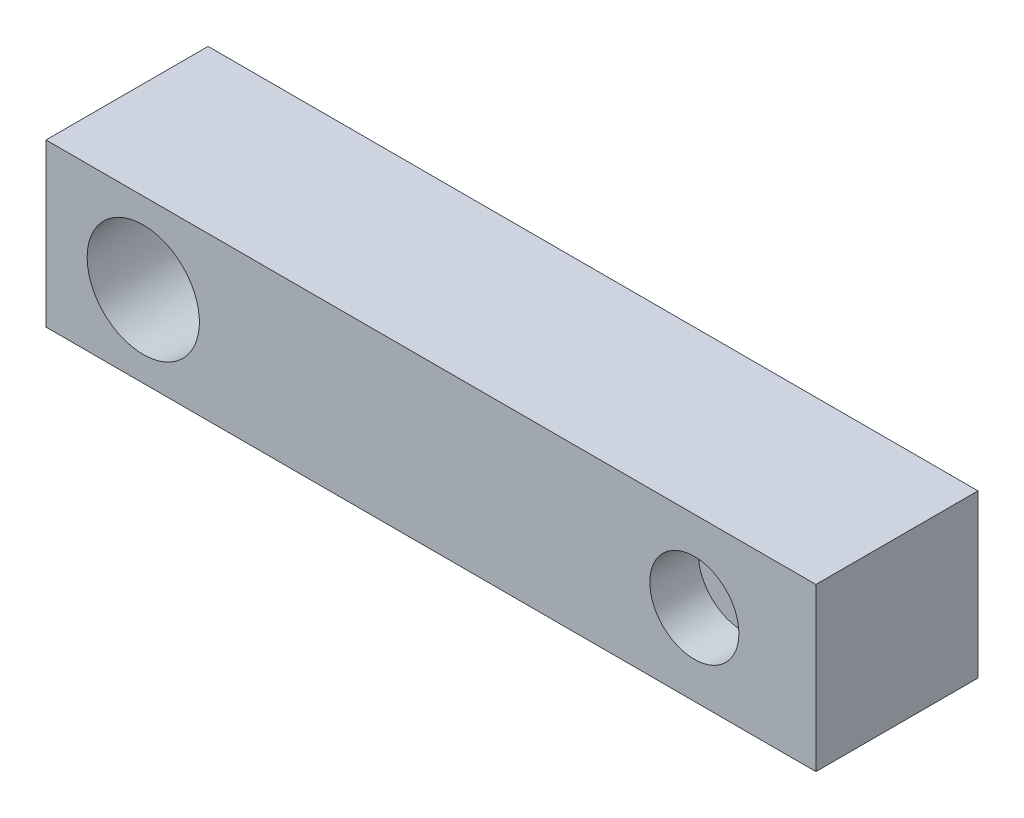
ISO-10303-21;
HEADER;
FILE_DESCRIPTION(('STEP AP214'),'2;1');
FILE_NAME('part.step','',(''),(''),'','','');
FILE_SCHEMA(('AUTOMOTIVE_DESIGN { 1 0 10303 214 1 1 1 1 }'));
ENDSEC;
DATA;
#1=APPLICATION_CONTEXT('core data for automotive mechanical design processes');
#2=APPLICATION_PROTOCOL_DEFINITION('international standard','automotive_design',2000,#1);
#3=PRODUCT_CONTEXT('',#1,'mechanical');
#4=PRODUCT('Part','Part','',(#3));
#5=PRODUCT_RELATED_PRODUCT_CATEGORY('part','',(#4));
#6=PRODUCT_DEFINITION_FORMATION('','',#4);
#7=PRODUCT_DEFINITION_CONTEXT('part definition',#1,'design');
#8=PRODUCT_DEFINITION('design','',#6,#7);
#9=PRODUCT_DEFINITION_SHAPE('','',#8);
#10=(LENGTH_UNIT() NAMED_UNIT(*) SI_UNIT(.MILLI.,.METRE.));
#11=(NAMED_UNIT(*) PLANE_ANGLE_UNIT() SI_UNIT($,.RADIAN.));
#12=(NAMED_UNIT(*) SI_UNIT($,.STERADIAN.) SOLID_ANGLE_UNIT());
#13=UNCERTAINTY_MEASURE_WITH_UNIT(LENGTH_MEASURE(1.E-05),#10,'distance_accuracy_value','');
#14=(GEOMETRIC_REPRESENTATION_CONTEXT(3) GLOBAL_UNCERTAINTY_ASSIGNED_CONTEXT((#13)) GLOBAL_UNIT_ASSIGNED_CONTEXT((#10,
#11,#12)) REPRESENTATION_CONTEXT('',''));
#15=CARTESIAN_POINT('',(0.,0.,0.));
#16=DIRECTION('',(0.,0.,1.));
#17=DIRECTION('',(1.,0.,0.));
#18=AXIS2_PLACEMENT_3D('',#15,#16,#17);
#19=CARTESIAN_POINT('',(68.0000000000001,0.,-3.33066907387547E-13));
#20=DIRECTION('',(0.,0.,-1.));
#21=DIRECTION('',(-1.,0.,0.));
#22=AXIS2_PLACEMENT_3D('',#19,#20,#21);
#23=CYLINDRICAL_SURFACE('',#22,2.75000000000001);
#24=CARTESIAN_POINT('',(68.,0.,-15.0000000000003));
#25=DIRECTION('',(0.,0.,-1.));
#26=DIRECTION('',(-1.,0.,0.));
#27=AXIS2_PLACEMENT_3D('',#24,#25,#26);
#28=CIRCLE('',#27,2.75000000000001);
#29=CARTESIAN_POINT('',(65.25,0.,-15.0000000000003));
#30=VERTEX_POINT('',#29);
#31=EDGE_CURVE('E131',#30,#30,#28,.T.);
#32=ORIENTED_EDGE('',*,*,#31,.T.);
#33=EDGE_LOOP('',(#32));
#34=FACE_BOUND('',#33,.T.);
#35=CARTESIAN_POINT('',(68.,0.,-6.00000000000034));
#36=DIRECTION('',(0.,0.,1.));
#37=DIRECTION('',(1.,0.,0.));
#38=AXIS2_PLACEMENT_3D('',#35,#36,#37);
#39=CIRCLE('',#38,2.75000000000001);
#40=CARTESIAN_POINT('',(70.75,0.,-6.00000000000034));
#41=VERTEX_POINT('',#40);
#42=EDGE_CURVE('E50',#41,#41,#39,.F.);
#43=ORIENTED_EDGE('',*,*,#42,.F.);
#44=EDGE_LOOP('',(#43));
#45=FACE_BOUND('',#44,.T.);
#46=ADVANCED_FACE('F46',(#34,#45),#23,.F.);
#47=CARTESIAN_POINT('',(0.,0.,0.));
#48=DIRECTION('',(0.,0.,-1.));
#49=DIRECTION('',(-1.,0.,0.));
#50=AXIS2_PLACEMENT_3D('',#47,#48,#49);
#51=CONICAL_SURFACE('',#50,6.92584167948768,0.0499164165500011);
#52=CARTESIAN_POINT('',(0.,0.,0.));
#53=DIRECTION('',(0.,0.,-1.));
#54=DIRECTION('',(-1.,0.,0.));
#55=AXIS2_PLACEMENT_3D('',#52,#53,#54);
#56=CIRCLE('',#55,6.92584167948768);
#57=CARTESIAN_POINT('',(-6.92584167948768,0.,0.));
#58=VERTEX_POINT('',#57);
#59=EDGE_CURVE('E63',#58,#58,#56,.T.);
#60=ORIENTED_EDGE('',*,*,#59,.F.);
#61=EDGE_LOOP('',(#60));
#62=FACE_BOUND('',#61,.T.);
#63=CARTESIAN_POINT('',(0.,3.33066907387547E-13,-20.));
#64=DIRECTION('',(0.,0.,-1.));
#65=DIRECTION('',(-1.,0.,0.));
#66=AXIS2_PLACEMENT_3D('',#63,#64,#65);
#67=CIRCLE('',#66,7.925);
#68=CARTESIAN_POINT('',(-7.92499999999999,3.33066907387547E-13,-20.));
#69=VERTEX_POINT('',#68);
#70=EDGE_CURVE('E105',#69,#69,#67,.T.);
#71=ORIENTED_EDGE('',*,*,#70,.T.);
#72=EDGE_LOOP('',(#71));
#73=FACE_BOUND('',#72,.T.);
#74=ADVANCED_FACE('F149',(#62,#73),#51,.F.);
#75=CARTESIAN_POINT('',(83.,10.,-20.0000000000004));
#76=DIRECTION('',(-1.,0.,0.));
#77=DIRECTION('',(0.,0.,1.));
#78=AXIS2_PLACEMENT_3D('',#75,#76,#77);
#79=PLANE('',#78);
#80=DIRECTION('',(0.,-1.,0.));
#81=VECTOR('',#80,1.);
#82=CARTESIAN_POINT('',(83.0000000000001,10.0000000000003,-3.33066907387547E-13));
#83=LINE('',#82,#81);
#84=CARTESIAN_POINT('',(83.0000000000001,10.0000000000003,-3.33066907387547E-13));
#85=VERTEX_POINT('',#84);
#86=CARTESIAN_POINT('',(83.0000000000001,-9.99999999999968,-3.33066907387547E-13));
#87=VERTEX_POINT('',#86);
#88=EDGE_CURVE('E87',#85,#87,#83,.T.);
#89=ORIENTED_EDGE('',*,*,#88,.T.);
#90=DIRECTION('',(0.,0.,1.));
#91=VECTOR('',#90,1.);
#92=CARTESIAN_POINT('',(83.,-10.,-20.0000000000004));
#93=LINE('',#92,#91);
#94=CARTESIAN_POINT('',(83.,-10.,-20.0000000000004));
#95=VERTEX_POINT('',#94);
#96=EDGE_CURVE('E113',#95,#87,#93,.T.);
#97=ORIENTED_EDGE('',*,*,#96,.F.);
#98=DIRECTION('',(0.,-1.,0.));
#99=VECTOR('',#98,1.);
#100=CARTESIAN_POINT('',(83.,10.,-20.0000000000004));
#101=LINE('',#100,#99);
#102=CARTESIAN_POINT('',(83.,10.,-20.0000000000004));
#103=VERTEX_POINT('',#102);
#104=EDGE_CURVE('E90',#103,#95,#101,.T.);
#105=ORIENTED_EDGE('',*,*,#104,.F.);
#106=DIRECTION('',(0.,0.,1.));
#107=VECTOR('',#106,1.);
#108=CARTESIAN_POINT('',(83.,10.,-20.0000000000004));
#109=LINE('',#108,#107);
#110=EDGE_CURVE('E11',#103,#85,#109,.T.);
#111=ORIENTED_EDGE('',*,*,#110,.T.);
#112=EDGE_LOOP('',(#89,#97,#105,#111));
#113=FACE_BOUND('',#112,.T.);
#114=ADVANCED_FACE('F85',(#113),#79,.F.);
#115=CARTESIAN_POINT('',(-11.9999999999998,10.,-20.));
#116=DIRECTION('',(0.,-1.,0.));
#117=DIRECTION('',(0.,0.,-1.));
#118=AXIS2_PLACEMENT_3D('',#115,#116,#117);
#119=PLANE('',#118);
#120=DIRECTION('',(1.,0.,0.));
#121=VECTOR('',#120,1.);
#122=CARTESIAN_POINT('',(-12.,10.0000000000001,0.));
#123=LINE('',#122,#121);
#124=CARTESIAN_POINT('',(-12.,10.0000000000001,0.));
#125=VERTEX_POINT('',#124);
#126=EDGE_CURVE('E95',#125,#85,#123,.T.);
#127=ORIENTED_EDGE('',*,*,#126,.T.);
#128=ORIENTED_EDGE('',*,*,#110,.F.);
#129=DIRECTION('',(1.,0.,0.));
#130=VECTOR('',#129,1.);
#131=CARTESIAN_POINT('',(-11.9999999999998,10.,-20.));
#132=LINE('',#131,#130);
#133=CARTESIAN_POINT('',(-11.9999999999998,10.,-20.));
#134=VERTEX_POINT('',#133);
#135=EDGE_CURVE('E110',#134,#103,#132,.T.);
#136=ORIENTED_EDGE('',*,*,#135,.F.);
#137=DIRECTION('',(0.,0.,1.));
#138=VECTOR('',#137,1.);
#139=CARTESIAN_POINT('',(-11.9999999999998,10.,-20.));
#140=LINE('',#139,#138);
#141=EDGE_CURVE('E56',#134,#125,#140,.T.);
#142=ORIENTED_EDGE('',*,*,#141,.T.);
#143=EDGE_LOOP('',(#127,#128,#136,#142));
#144=FACE_BOUND('',#143,.T.);
#145=ADVANCED_FACE('F96',(#144),#119,.F.);
#146=CARTESIAN_POINT('',(-11.9999999999998,-10.,-20.0000000000003));
#147=DIRECTION('',(1.,0.,0.));
#148=DIRECTION('',(0.,1.,0.));
#149=AXIS2_PLACEMENT_3D('',#146,#147,#148);
#150=PLANE('',#149);
#151=DIRECTION('',(0.,1.,0.));
#152=VECTOR('',#151,1.);
#153=CARTESIAN_POINT('',(-12.,-9.99999999999995,-3.33066907387547E-13));
#154=LINE('',#153,#152);
#155=CARTESIAN_POINT('',(-12.,-9.99999999999995,-3.33066907387547E-13));
#156=VERTEX_POINT('',#155);
#157=EDGE_CURVE('E100',#156,#125,#154,.T.);
#158=ORIENTED_EDGE('',*,*,#157,.T.);
#159=ORIENTED_EDGE('',*,*,#141,.F.);
#160=DIRECTION('',(0.,1.,0.));
#161=VECTOR('',#160,1.);
#162=CARTESIAN_POINT('',(-11.9999999999998,-10.,-20.0000000000003));
#163=LINE('',#162,#161);
#164=CARTESIAN_POINT('',(-11.9999999999998,-10.,-20.0000000000003));
#165=VERTEX_POINT('',#164);
#166=EDGE_CURVE('E108',#165,#134,#163,.T.);
#167=ORIENTED_EDGE('',*,*,#166,.F.);
#168=DIRECTION('',(0.,0.,1.));
#169=VECTOR('',#168,1.);
#170=CARTESIAN_POINT('',(-11.9999999999998,-10.,-20.0000000000003));
#171=LINE('',#170,#169);
#172=EDGE_CURVE('E116',#165,#156,#171,.T.);
#173=ORIENTED_EDGE('',*,*,#172,.T.);
#174=EDGE_LOOP('',(#158,#159,#167,#173));
#175=FACE_BOUND('',#174,.T.);
#176=ADVANCED_FACE('F168',(#175),#150,.F.);
#177=CARTESIAN_POINT('',(83.,-10.,-20.0000000000004));
#178=DIRECTION('',(0.,1.,0.));
#179=DIRECTION('',(1.,0.,0.));
#180=AXIS2_PLACEMENT_3D('',#177,#178,#179);
#181=PLANE('',#180);
#182=DIRECTION('',(-1.,0.,0.));
#183=VECTOR('',#182,1.);
#184=CARTESIAN_POINT('',(83.0000000000001,-9.99999999999968,-3.33066907387547E-13));
#185=LINE('',#184,#183);
#186=EDGE_CURVE('E103',#87,#156,#185,.T.);
#187=ORIENTED_EDGE('',*,*,#186,.T.);
#188=ORIENTED_EDGE('',*,*,#172,.F.);
#189=DIRECTION('',(-1.,0.,0.));
#190=VECTOR('',#189,1.);
#191=CARTESIAN_POINT('',(83.,-10.,-20.0000000000004));
#192=LINE('',#191,#190);
#193=EDGE_CURVE('E111',#95,#165,#192,.T.);
#194=ORIENTED_EDGE('',*,*,#193,.F.);
#195=ORIENTED_EDGE('',*,*,#96,.T.);
#196=EDGE_LOOP('',(#187,#188,#194,#195));
#197=FACE_BOUND('',#196,.T.);
#198=ADVANCED_FACE('F171',(#197),#181,.F.);
#199=CARTESIAN_POINT('',(-12.,-9.99999999999995,-3.33066907387547E-13));
#200=DIRECTION('',(0.,0.,-1.));
#201=DIRECTION('',(0.,-1.,0.));
#202=AXIS2_PLACEMENT_3D('',#199,#200,#201);
#203=PLANE('',#202);
#204=CARTESIAN_POINT('',(68.0000000000001,0.,-3.33066907387547E-13));
#205=DIRECTION('',(0.,0.,1.));
#206=DIRECTION('',(1.,0.,0.));
#207=AXIS2_PLACEMENT_3D('',#204,#205,#206);
#208=CIRCLE('',#207,5.5);
#209=CARTESIAN_POINT('',(73.5000000000001,0.,-3.33066907387547E-13));
#210=VERTEX_POINT('',#209);
#211=EDGE_CURVE('E136',#210,#210,#208,.T.);
#212=ORIENTED_EDGE('',*,*,#211,.F.);
#213=EDGE_LOOP('',(#212));
#214=FACE_BOUND('',#213,.T.);
#215=ORIENTED_EDGE('',*,*,#59,.T.);
#216=EDGE_LOOP('',(#215));
#217=FACE_BOUND('',#216,.T.);
#218=ORIENTED_EDGE('',*,*,#186,.F.);
#219=ORIENTED_EDGE('',*,*,#88,.F.);
#220=ORIENTED_EDGE('',*,*,#126,.F.);
#221=ORIENTED_EDGE('',*,*,#157,.F.);
#222=EDGE_LOOP('',(#218,#219,#220,#221));
#223=FACE_BOUND('',#222,.T.);
#224=ADVANCED_FACE('F101',(#214,#217,#223),#203,.F.);
#225=CARTESIAN_POINT('',(-11.9999999999998,-10.,-20.0000000000003));
#226=DIRECTION('',(0.,0.,-1.));
#227=DIRECTION('',(0.,-1.,0.));
#228=AXIS2_PLACEMENT_3D('',#225,#226,#227);
#229=PLANE('',#228);
#230=CARTESIAN_POINT('',(68.,0.,-20.0000000000003));
#231=DIRECTION('',(0.,0.,-1.));
#232=DIRECTION('',(-1.,0.,0.));
#233=AXIS2_PLACEMENT_3D('',#230,#231,#232);
#234=CIRCLE('',#233,7.5);
#235=CARTESIAN_POINT('',(60.5,0.,-20.0000000000003));
#236=VERTEX_POINT('',#235);
#237=EDGE_CURVE('E128',#236,#236,#234,.T.);
#238=ORIENTED_EDGE('',*,*,#237,.F.);
#239=EDGE_LOOP('',(#238));
#240=FACE_BOUND('',#239,.T.);
#241=ORIENTED_EDGE('',*,*,#70,.F.);
#242=EDGE_LOOP('',(#241));
#243=FACE_BOUND('',#242,.T.);
#244=ORIENTED_EDGE('',*,*,#193,.T.);
#245=ORIENTED_EDGE('',*,*,#166,.T.);
#246=ORIENTED_EDGE('',*,*,#135,.T.);
#247=ORIENTED_EDGE('',*,*,#104,.T.);
#248=EDGE_LOOP('',(#244,#245,#246,#247));
#249=FACE_BOUND('',#248,.T.);
#250=ADVANCED_FACE('F48',(#240,#243,#249),#229,.T.);
#251=CARTESIAN_POINT('',(68.,0.,-15.0000000000003));
#252=DIRECTION('',(0.,0.,-1.));
#253=DIRECTION('',(-1.,0.,0.));
#254=AXIS2_PLACEMENT_3D('',#251,#252,#253);
#255=CYLINDRICAL_SURFACE('',#254,7.5);
#256=CARTESIAN_POINT('',(68.,0.,-15.0000000000003));
#257=DIRECTION('',(0.,0.,-1.));
#258=DIRECTION('',(-1.,0.,0.));
#259=AXIS2_PLACEMENT_3D('',#256,#257,#258);
#260=CIRCLE('',#259,7.5);
#261=CARTESIAN_POINT('',(60.5,0.,-15.0000000000003));
#262=VERTEX_POINT('',#261);
#263=EDGE_CURVE('E121',#262,#262,#260,.T.);
#264=ORIENTED_EDGE('',*,*,#263,.F.);
#265=EDGE_LOOP('',(#264));
#266=FACE_BOUND('',#265,.T.);
#267=ORIENTED_EDGE('',*,*,#237,.T.);
#268=EDGE_LOOP('',(#267));
#269=FACE_BOUND('',#268,.T.);
#270=ADVANCED_FACE('F163',(#266,#269),#255,.F.);
#271=CARTESIAN_POINT('',(68.,0.,-15.0000000000003));
#272=DIRECTION('',(0.,0.,-1.));
#273=DIRECTION('',(-1.,0.,0.));
#274=AXIS2_PLACEMENT_3D('',#271,#272,#273);
#275=PLANE('',#274);
#276=ORIENTED_EDGE('',*,*,#31,.F.);
#277=EDGE_LOOP('',(#276));
#278=FACE_BOUND('',#277,.T.);
#279=ORIENTED_EDGE('',*,*,#263,.T.);
#280=EDGE_LOOP('',(#279));
#281=FACE_BOUND('',#280,.T.);
#282=ADVANCED_FACE('F160',(#278,#281),#275,.T.);
#283=CARTESIAN_POINT('',(68.,0.,-6.00000000000034));
#284=DIRECTION('',(0.,0.,1.));
#285=DIRECTION('',(1.,0.,0.));
#286=AXIS2_PLACEMENT_3D('',#283,#284,#285);
#287=PLANE('',#286);
#288=CARTESIAN_POINT('',(68.,0.,-6.00000000000034));
#289=DIRECTION('',(0.,0.,1.));
#290=DIRECTION('',(1.,0.,0.));
#291=AXIS2_PLACEMENT_3D('',#288,#289,#290);
#292=CIRCLE('',#291,5.5);
#293=CARTESIAN_POINT('',(73.5,0.,-6.00000000000034));
#294=VERTEX_POINT('',#293);
#295=EDGE_CURVE('E139',#294,#294,#292,.T.);
#296=ORIENTED_EDGE('',*,*,#295,.T.);
#297=EDGE_LOOP('',(#296));
#298=FACE_BOUND('',#297,.T.);
#299=ORIENTED_EDGE('',*,*,#42,.T.);
#300=EDGE_LOOP('',(#299));
#301=FACE_BOUND('',#300,.T.);
#302=ADVANCED_FACE('F146',(#298,#301),#287,.T.);
#303=CARTESIAN_POINT('',(68.,0.,-6.00000000000034));
#304=DIRECTION('',(0.,0.,1.));
#305=DIRECTION('',(1.,0.,0.));
#306=AXIS2_PLACEMENT_3D('',#303,#304,#305);
#307=CYLINDRICAL_SURFACE('',#306,5.5);
#308=ORIENTED_EDGE('',*,*,#295,.F.);
#309=EDGE_LOOP('',(#308));
#310=FACE_BOUND('',#309,.T.);
#311=ORIENTED_EDGE('',*,*,#211,.T.);
#312=EDGE_LOOP('',(#311));
#313=FACE_BOUND('',#312,.T.);
#314=ADVANCED_FACE('F158',(#310,#313),#307,.F.);
#315=CLOSED_SHELL('',(#46,#74,#114,#145,#176,#198,#224,#250,#270,#282,#302,#314));
#316=MANIFOLD_SOLID_BREP('B2',#315);
#317=ADVANCED_BREP_SHAPE_REPRESENTATION('',(#18,#316),#14);
#318=SHAPE_DEFINITION_REPRESENTATION(#9,#317);
ENDSEC;
END-ISO-10303-21;
